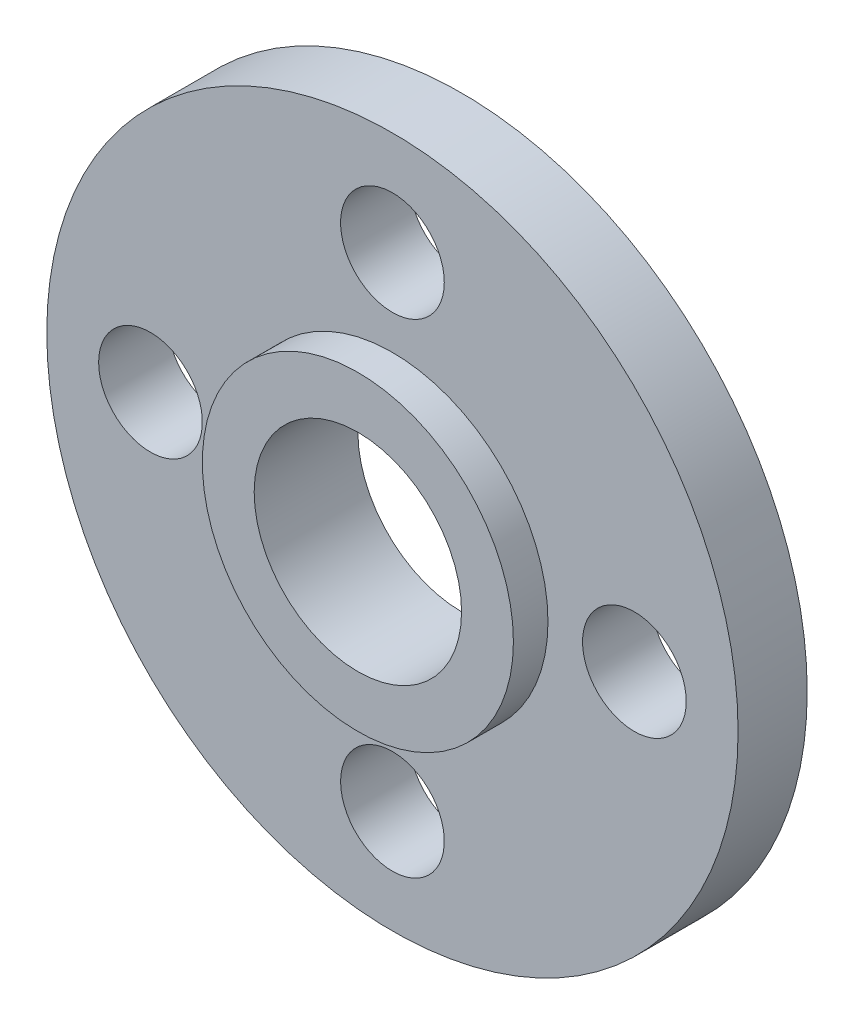
ISO-10303-21;
HEADER;
FILE_DESCRIPTION(('STEP AP214'),'2;1');
FILE_NAME('part.step','',(''),(''),'','','');
FILE_SCHEMA(('AUTOMOTIVE_DESIGN { 1 0 10303 214 1 1 1 1 }'));
ENDSEC;
DATA;
#1=APPLICATION_CONTEXT('core data for automotive mechanical design processes');
#2=APPLICATION_PROTOCOL_DEFINITION('international standard','automotive_design',2000,#1);
#3=PRODUCT_CONTEXT('',#1,'mechanical');
#4=PRODUCT('Part','Part','',(#3));
#5=PRODUCT_RELATED_PRODUCT_CATEGORY('part','',(#4));
#6=PRODUCT_DEFINITION_FORMATION('','',#4);
#7=PRODUCT_DEFINITION_CONTEXT('part definition',#1,'design');
#8=PRODUCT_DEFINITION('design','',#6,#7);
#9=PRODUCT_DEFINITION_SHAPE('','',#8);
#10=(LENGTH_UNIT() NAMED_UNIT(*) SI_UNIT(.MILLI.,.METRE.));
#11=(NAMED_UNIT(*) PLANE_ANGLE_UNIT() SI_UNIT($,.RADIAN.));
#12=(NAMED_UNIT(*) SI_UNIT($,.STERADIAN.) SOLID_ANGLE_UNIT());
#13=UNCERTAINTY_MEASURE_WITH_UNIT(LENGTH_MEASURE(1.E-05),#10,'distance_accuracy_value','');
#14=(GEOMETRIC_REPRESENTATION_CONTEXT(3) GLOBAL_UNCERTAINTY_ASSIGNED_CONTEXT((#13)) GLOBAL_UNIT_ASSIGNED_CONTEXT((#10,
#11,#12)) REPRESENTATION_CONTEXT('',''));
#15=CARTESIAN_POINT('',(0.,0.,0.));
#16=DIRECTION('',(0.,0.,1.));
#17=DIRECTION('',(1.,0.,0.));
#18=AXIS2_PLACEMENT_3D('',#15,#16,#17);
#19=CARTESIAN_POINT('',(0.,0.,2.));
#20=DIRECTION('',(0.,0.,1.));
#21=DIRECTION('',(1.,0.,0.));
#22=AXIS2_PLACEMENT_3D('',#19,#20,#21);
#23=PLANE('',#22);
#24=CARTESIAN_POINT('',(0.,0.,2.));
#25=DIRECTION('',(0.,0.,1.));
#26=DIRECTION('',(1.,0.,0.));
#27=AXIS2_PLACEMENT_3D('',#24,#25,#26);
#28=CIRCLE('',#27,10.);
#29=CARTESIAN_POINT('',(10.,0.,2.));
#30=VERTEX_POINT('',#29);
#31=EDGE_CURVE('E10',#30,#30,#28,.T.);
#32=ORIENTED_EDGE('',*,*,#31,.T.);
#33=EDGE_LOOP('',(#32));
#34=FACE_BOUND('',#33,.T.);
#35=CARTESIAN_POINT('',(-7.,0.,2.));
#36=DIRECTION('',(0.,0.,1.));
#37=DIRECTION('',(-1.,0.,0.));
#38=AXIS2_PLACEMENT_3D('',#35,#36,#37);
#39=CIRCLE('',#38,1.5);
#40=CARTESIAN_POINT('',(-8.5,0.,2.));
#41=VERTEX_POINT('',#40);
#42=EDGE_CURVE('E45',#41,#41,#39,.T.);
#43=ORIENTED_EDGE('',*,*,#42,.F.);
#44=EDGE_LOOP('',(#43));
#45=FACE_BOUND('',#44,.T.);
#46=CARTESIAN_POINT('',(0.,-7.,2.));
#47=DIRECTION('',(0.,0.,1.));
#48=DIRECTION('',(-1.,0.,0.));
#49=AXIS2_PLACEMENT_3D('',#46,#47,#48);
#50=CIRCLE('',#49,1.5);
#51=CARTESIAN_POINT('',(-1.5,-7.,2.));
#52=VERTEX_POINT('',#51);
#53=EDGE_CURVE('E52',#52,#52,#50,.T.);
#54=ORIENTED_EDGE('',*,*,#53,.F.);
#55=EDGE_LOOP('',(#54));
#56=FACE_BOUND('',#55,.T.);
#57=CARTESIAN_POINT('',(7.,0.,2.));
#58=DIRECTION('',(0.,0.,1.));
#59=DIRECTION('',(1.,0.,0.));
#60=AXIS2_PLACEMENT_3D('',#57,#58,#59);
#61=CIRCLE('',#60,1.5);
#62=CARTESIAN_POINT('',(8.5,0.,2.));
#63=VERTEX_POINT('',#62);
#64=EDGE_CURVE('E58',#63,#63,#61,.T.);
#65=ORIENTED_EDGE('',*,*,#64,.F.);
#66=EDGE_LOOP('',(#65));
#67=FACE_BOUND('',#66,.T.);
#68=CARTESIAN_POINT('',(0.,7.,2.));
#69=DIRECTION('',(0.,0.,1.));
#70=DIRECTION('',(1.,0.,0.));
#71=AXIS2_PLACEMENT_3D('',#68,#69,#70);
#72=CIRCLE('',#71,1.5);
#73=CARTESIAN_POINT('',(1.5,7.,2.));
#74=VERTEX_POINT('',#73);
#75=EDGE_CURVE('E64',#74,#74,#72,.T.);
#76=ORIENTED_EDGE('',*,*,#75,.F.);
#77=EDGE_LOOP('',(#76));
#78=FACE_BOUND('',#77,.T.);
#79=CARTESIAN_POINT('',(0.,0.,2.));
#80=DIRECTION('',(0.,0.,1.));
#81=DIRECTION('',(1.,0.,0.));
#82=AXIS2_PLACEMENT_3D('',#79,#80,#81);
#83=CIRCLE('',#82,4.5);
#84=CARTESIAN_POINT('',(4.5,0.,2.));
#85=VERTEX_POINT('',#84);
#86=EDGE_CURVE('E72',#85,#85,#83,.T.);
#87=ORIENTED_EDGE('',*,*,#86,.F.);
#88=EDGE_LOOP('',(#87));
#89=FACE_BOUND('',#88,.T.);
#90=ADVANCED_FACE('F32',(#34,#45,#56,#67,#78,#89),#23,.T.);
#91=CARTESIAN_POINT('',(0.,0.,2.));
#92=DIRECTION('',(0.,0.,-1.));
#93=DIRECTION('',(-1.,0.,0.));
#94=AXIS2_PLACEMENT_3D('',#91,#92,#93);
#95=CYLINDRICAL_SURFACE('',#94,10.);
#96=ORIENTED_EDGE('',*,*,#31,.F.);
#97=EDGE_LOOP('',(#96));
#98=FACE_BOUND('',#97,.T.);
#99=CARTESIAN_POINT('',(0.,0.,0.));
#100=DIRECTION('',(0.,0.,1.));
#101=DIRECTION('',(1.,0.,0.));
#102=AXIS2_PLACEMENT_3D('',#99,#100,#101);
#103=CIRCLE('',#102,10.);
#104=CARTESIAN_POINT('',(10.,0.,0.));
#105=VERTEX_POINT('',#104);
#106=EDGE_CURVE('E36',#105,#105,#103,.T.);
#107=ORIENTED_EDGE('',*,*,#106,.T.);
#108=EDGE_LOOP('',(#107));
#109=FACE_BOUND('',#108,.T.);
#110=ADVANCED_FACE('F34',(#98,#109),#95,.T.);
#111=CARTESIAN_POINT('',(0.,0.,0.));
#112=DIRECTION('',(0.,0.,1.));
#113=DIRECTION('',(1.,0.,0.));
#114=AXIS2_PLACEMENT_3D('',#111,#112,#113);
#115=PLANE('',#114);
#116=CARTESIAN_POINT('',(0.,0.,0.));
#117=DIRECTION('',(0.,0.,1.));
#118=DIRECTION('',(1.,0.,0.));
#119=AXIS2_PLACEMENT_3D('',#116,#117,#118);
#120=CIRCLE('',#119,3.);
#121=CARTESIAN_POINT('',(3.,0.,0.));
#122=VERTEX_POINT('',#121);
#123=EDGE_CURVE('E49',#122,#122,#120,.T.);
#124=ORIENTED_EDGE('',*,*,#123,.T.);
#125=EDGE_LOOP('',(#124));
#126=FACE_BOUND('',#125,.T.);
#127=CARTESIAN_POINT('',(0.,7.,0.));
#128=DIRECTION('',(0.,0.,1.));
#129=DIRECTION('',(1.,0.,0.));
#130=AXIS2_PLACEMENT_3D('',#127,#128,#129);
#131=CIRCLE('',#130,1.5);
#132=CARTESIAN_POINT('',(1.5,7.,0.));
#133=VERTEX_POINT('',#132);
#134=EDGE_CURVE('E43',#133,#133,#131,.T.);
#135=ORIENTED_EDGE('',*,*,#134,.T.);
#136=EDGE_LOOP('',(#135));
#137=FACE_BOUND('',#136,.T.);
#138=CARTESIAN_POINT('',(7.,0.,0.));
#139=DIRECTION('',(0.,0.,1.));
#140=DIRECTION('',(1.,0.,0.));
#141=AXIS2_PLACEMENT_3D('',#138,#139,#140);
#142=CIRCLE('',#141,1.5);
#143=CARTESIAN_POINT('',(8.5,0.,0.));
#144=VERTEX_POINT('',#143);
#145=EDGE_CURVE('E61',#144,#144,#142,.T.);
#146=ORIENTED_EDGE('',*,*,#145,.T.);
#147=EDGE_LOOP('',(#146));
#148=FACE_BOUND('',#147,.T.);
#149=CARTESIAN_POINT('',(0.,-7.,0.));
#150=DIRECTION('',(0.,0.,1.));
#151=DIRECTION('',(-1.,0.,0.));
#152=AXIS2_PLACEMENT_3D('',#149,#150,#151);
#153=CIRCLE('',#152,1.5);
#154=CARTESIAN_POINT('',(-1.5,-7.,0.));
#155=VERTEX_POINT('',#154);
#156=EDGE_CURVE('E55',#155,#155,#153,.T.);
#157=ORIENTED_EDGE('',*,*,#156,.T.);
#158=EDGE_LOOP('',(#157));
#159=FACE_BOUND('',#158,.T.);
#160=CARTESIAN_POINT('',(-7.,0.,0.));
#161=DIRECTION('',(0.,0.,1.));
#162=DIRECTION('',(-1.,0.,0.));
#163=AXIS2_PLACEMENT_3D('',#160,#161,#162);
#164=CIRCLE('',#163,1.5);
#165=CARTESIAN_POINT('',(-8.5,0.,0.));
#166=VERTEX_POINT('',#165);
#167=EDGE_CURVE('E48',#166,#166,#164,.T.);
#168=ORIENTED_EDGE('',*,*,#167,.T.);
#169=EDGE_LOOP('',(#168));
#170=FACE_BOUND('',#169,.T.);
#171=ORIENTED_EDGE('',*,*,#106,.F.);
#172=EDGE_LOOP('',(#171));
#173=FACE_BOUND('',#172,.T.);
#174=ADVANCED_FACE('F102',(#126,#137,#148,#159,#170,#173),#115,.F.);
#175=CARTESIAN_POINT('',(-7.,0.,0.));
#176=DIRECTION('',(0.,0.,1.));
#177=DIRECTION('',(1.,0.,0.));
#178=AXIS2_PLACEMENT_3D('',#175,#176,#177);
#179=CYLINDRICAL_SURFACE('',#178,1.5);
#180=ORIENTED_EDGE('',*,*,#167,.F.);
#181=EDGE_LOOP('',(#180));
#182=FACE_BOUND('',#181,.T.);
#183=ORIENTED_EDGE('',*,*,#42,.T.);
#184=EDGE_LOOP('',(#183));
#185=FACE_BOUND('',#184,.T.);
#186=ADVANCED_FACE('F106',(#182,#185),#179,.F.);
#187=CARTESIAN_POINT('',(0.,-7.,0.));
#188=DIRECTION('',(0.,0.,1.));
#189=DIRECTION('',(1.,0.,0.));
#190=AXIS2_PLACEMENT_3D('',#187,#188,#189);
#191=CYLINDRICAL_SURFACE('',#190,1.5);
#192=ORIENTED_EDGE('',*,*,#156,.F.);
#193=EDGE_LOOP('',(#192));
#194=FACE_BOUND('',#193,.T.);
#195=ORIENTED_EDGE('',*,*,#53,.T.);
#196=EDGE_LOOP('',(#195));
#197=FACE_BOUND('',#196,.T.);
#198=ADVANCED_FACE('F113',(#194,#197),#191,.F.);
#199=CARTESIAN_POINT('',(7.,0.,0.));
#200=DIRECTION('',(0.,0.,1.));
#201=DIRECTION('',(1.,0.,0.));
#202=AXIS2_PLACEMENT_3D('',#199,#200,#201);
#203=CYLINDRICAL_SURFACE('',#202,1.5);
#204=ORIENTED_EDGE('',*,*,#145,.F.);
#205=EDGE_LOOP('',(#204));
#206=FACE_BOUND('',#205,.T.);
#207=ORIENTED_EDGE('',*,*,#64,.T.);
#208=EDGE_LOOP('',(#207));
#209=FACE_BOUND('',#208,.T.);
#210=ADVANCED_FACE('F140',(#206,#209),#203,.F.);
#211=CARTESIAN_POINT('',(0.,7.,0.));
#212=DIRECTION('',(0.,0.,1.));
#213=DIRECTION('',(1.,0.,0.));
#214=AXIS2_PLACEMENT_3D('',#211,#212,#213);
#215=CYLINDRICAL_SURFACE('',#214,1.5);
#216=ORIENTED_EDGE('',*,*,#134,.F.);
#217=EDGE_LOOP('',(#216));
#218=FACE_BOUND('',#217,.T.);
#219=ORIENTED_EDGE('',*,*,#75,.T.);
#220=EDGE_LOOP('',(#219));
#221=FACE_BOUND('',#220,.T.);
#222=ADVANCED_FACE('F94',(#218,#221),#215,.F.);
#223=CARTESIAN_POINT('',(0.,0.,0.));
#224=DIRECTION('',(0.,0.,1.));
#225=DIRECTION('',(1.,0.,0.));
#226=AXIS2_PLACEMENT_3D('',#223,#224,#225);
#227=CYLINDRICAL_SURFACE('',#226,3.);
#228=ORIENTED_EDGE('',*,*,#123,.F.);
#229=EDGE_LOOP('',(#228));
#230=FACE_BOUND('',#229,.T.);
#231=CARTESIAN_POINT('',(0.,0.,3.));
#232=DIRECTION('',(0.,0.,1.));
#233=DIRECTION('',(1.,0.,0.));
#234=AXIS2_PLACEMENT_3D('',#231,#232,#233);
#235=CIRCLE('',#234,3.);
#236=CARTESIAN_POINT('',(3.,0.,3.));
#237=VERTEX_POINT('',#236);
#238=EDGE_CURVE('E75',#237,#237,#235,.T.);
#239=ORIENTED_EDGE('',*,*,#238,.T.);
#240=EDGE_LOOP('',(#239));
#241=FACE_BOUND('',#240,.T.);
#242=ADVANCED_FACE('F81',(#230,#241),#227,.F.);
#243=CARTESIAN_POINT('',(0.,0.,3.));
#244=DIRECTION('',(0.,0.,1.));
#245=DIRECTION('',(1.,0.,0.));
#246=AXIS2_PLACEMENT_3D('',#243,#244,#245);
#247=PLANE('',#246);
#248=CARTESIAN_POINT('',(0.,0.,3.));
#249=DIRECTION('',(0.,0.,1.));
#250=DIRECTION('',(1.,0.,0.));
#251=AXIS2_PLACEMENT_3D('',#248,#249,#250);
#252=CIRCLE('',#251,4.5);
#253=CARTESIAN_POINT('',(4.5,0.,3.));
#254=VERTEX_POINT('',#253);
#255=EDGE_CURVE('E71',#254,#254,#252,.T.);
#256=ORIENTED_EDGE('',*,*,#255,.T.);
#257=EDGE_LOOP('',(#256));
#258=FACE_BOUND('',#257,.T.);
#259=ORIENTED_EDGE('',*,*,#238,.F.);
#260=EDGE_LOOP('',(#259));
#261=FACE_BOUND('',#260,.T.);
#262=ADVANCED_FACE('F83',(#258,#261),#247,.T.);
#263=CARTESIAN_POINT('',(0.,0.,3.));
#264=DIRECTION('',(0.,0.,-1.));
#265=DIRECTION('',(-1.,0.,0.));
#266=AXIS2_PLACEMENT_3D('',#263,#264,#265);
#267=CYLINDRICAL_SURFACE('',#266,4.5);
#268=ORIENTED_EDGE('',*,*,#255,.F.);
#269=EDGE_LOOP('',(#268));
#270=FACE_BOUND('',#269,.T.);
#271=ORIENTED_EDGE('',*,*,#86,.T.);
#272=EDGE_LOOP('',(#271));
#273=FACE_BOUND('',#272,.T.);
#274=ADVANCED_FACE('F85',(#270,#273),#267,.T.);
#275=CLOSED_SHELL('',(#90,#110,#174,#186,#198,#210,#222,#242,#262,#274));
#276=MANIFOLD_SOLID_BREP('B2',#275);
#277=ADVANCED_BREP_SHAPE_REPRESENTATION('',(#18,#276),#14);
#278=SHAPE_DEFINITION_REPRESENTATION(#9,#277);
ENDSEC;
END-ISO-10303-21;
